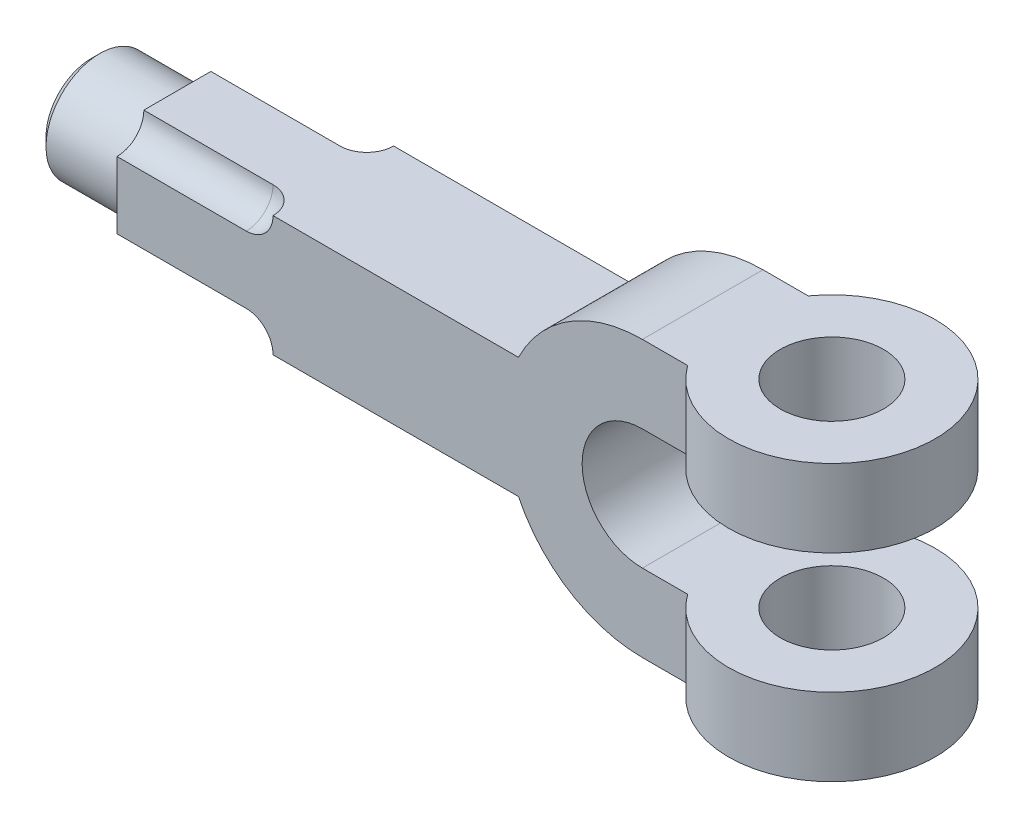
ISO-10303-21;
HEADER;
FILE_DESCRIPTION(('STEP AP214'),'2;1');
FILE_NAME('part.step','',(''),(''),'','','');
FILE_SCHEMA(('AUTOMOTIVE_DESIGN { 1 0 10303 214 1 1 1 1 }'));
ENDSEC;
DATA;
#1=APPLICATION_CONTEXT('core data for automotive mechanical design processes');
#2=APPLICATION_PROTOCOL_DEFINITION('international standard','automotive_design',2000,#1);
#3=PRODUCT_CONTEXT('',#1,'mechanical');
#4=PRODUCT('Part','Part','',(#3));
#5=PRODUCT_RELATED_PRODUCT_CATEGORY('part','',(#4));
#6=PRODUCT_DEFINITION_FORMATION('','',#4);
#7=PRODUCT_DEFINITION_CONTEXT('part definition',#1,'design');
#8=PRODUCT_DEFINITION('design','',#6,#7);
#9=PRODUCT_DEFINITION_SHAPE('','',#8);
#10=(LENGTH_UNIT() NAMED_UNIT(*) SI_UNIT(.MILLI.,.METRE.));
#11=(NAMED_UNIT(*) PLANE_ANGLE_UNIT() SI_UNIT($,.RADIAN.));
#12=(NAMED_UNIT(*) SI_UNIT($,.STERADIAN.) SOLID_ANGLE_UNIT());
#13=UNCERTAINTY_MEASURE_WITH_UNIT(LENGTH_MEASURE(1.E-05),#10,'distance_accuracy_value','');
#14=(GEOMETRIC_REPRESENTATION_CONTEXT(3) GLOBAL_UNCERTAINTY_ASSIGNED_CONTEXT((#13)) GLOBAL_UNIT_ASSIGNED_CONTEXT((#10,
#11,#12)) REPRESENTATION_CONTEXT('',''));
#15=CARTESIAN_POINT('',(0.,0.,0.));
#16=DIRECTION('',(0.,0.,1.));
#17=DIRECTION('',(1.,0.,0.));
#18=AXIS2_PLACEMENT_3D('',#15,#16,#17);
#19=CARTESIAN_POINT('',(-122.,0.,0.));
#20=DIRECTION('',(-1.,0.,0.));
#21=DIRECTION('',(0.,0.,1.));
#22=AXIS2_PLACEMENT_3D('',#19,#20,#21);
#23=PLANE('',#22);
#24=DIRECTION('',(0.,1.,0.));
#25=VECTOR('',#24,1.);
#26=CARTESIAN_POINT('',(-122.,14.,-14.));
#27=LINE('',#26,#25);
#28=CARTESIAN_POINT('',(-122.,-7.78,-14.));
#29=VERTEX_POINT('',#28);
#30=CARTESIAN_POINT('',(-122.,7.78,-14.));
#31=VERTEX_POINT('',#30);
#32=EDGE_CURVE('E228',#29,#31,#27,.T.);
#33=ORIENTED_EDGE('',*,*,#32,.F.);
#34=CARTESIAN_POINT('',(-122.,-14.,-14.));
#35=DIRECTION('',(1.,0.,0.));
#36=DIRECTION('',(0.,0.,1.));
#37=AXIS2_PLACEMENT_3D('',#34,#35,#36);
#38=CIRCLE('',#37,6.22);
#39=CARTESIAN_POINT('',(-122.,-14.,-7.78000000000001));
#40=VERTEX_POINT('',#39);
#41=EDGE_CURVE('E177',#29,#40,#38,.T.);
#42=ORIENTED_EDGE('',*,*,#41,.T.);
#43=DIRECTION('',(0.,0.,-1.));
#44=VECTOR('',#43,1.);
#45=CARTESIAN_POINT('',(-122.,-14.,-14.));
#46=LINE('',#45,#44);
#47=CARTESIAN_POINT('',(-122.,-14.,7.78000000000001));
#48=VERTEX_POINT('',#47);
#49=EDGE_CURVE('E190',#48,#40,#46,.T.);
#50=ORIENTED_EDGE('',*,*,#49,.F.);
#51=CARTESIAN_POINT('',(-122.,-14.,14.));
#52=DIRECTION('',(-1.,0.,0.));
#53=DIRECTION('',(0.,0.,-1.));
#54=AXIS2_PLACEMENT_3D('',#51,#52,#53);
#55=CIRCLE('',#54,6.22);
#56=CARTESIAN_POINT('',(-122.,-7.78,14.));
#57=VERTEX_POINT('',#56);
#58=EDGE_CURVE('E192',#57,#48,#55,.T.);
#59=ORIENTED_EDGE('',*,*,#58,.F.);
#60=DIRECTION('',(0.,-1.,0.));
#61=VECTOR('',#60,1.);
#62=CARTESIAN_POINT('',(-122.,14.,14.));
#63=LINE('',#62,#61);
#64=CARTESIAN_POINT('',(-122.,7.78,14.));
#65=VERTEX_POINT('',#64);
#66=EDGE_CURVE('E224',#65,#57,#63,.T.);
#67=ORIENTED_EDGE('',*,*,#66,.F.);
#68=CARTESIAN_POINT('',(-122.,14.,14.));
#69=DIRECTION('',(1.,0.,0.));
#70=DIRECTION('',(0.,0.,-1.));
#71=AXIS2_PLACEMENT_3D('',#68,#69,#70);
#72=CIRCLE('',#71,6.22);
#73=CARTESIAN_POINT('',(-122.,14.,7.78000000000001));
#74=VERTEX_POINT('',#73);
#75=EDGE_CURVE('E215',#65,#74,#72,.T.);
#76=ORIENTED_EDGE('',*,*,#75,.T.);
#77=DIRECTION('',(0.,0.,1.));
#78=VECTOR('',#77,1.);
#79=CARTESIAN_POINT('',(-122.,14.,-14.));
#80=LINE('',#79,#78);
#81=CARTESIAN_POINT('',(-122.,14.,-7.78000000000001));
#82=VERTEX_POINT('',#81);
#83=EDGE_CURVE('E225',#82,#74,#80,.T.);
#84=ORIENTED_EDGE('',*,*,#83,.F.);
#85=CARTESIAN_POINT('',(-122.,14.,-14.));
#86=DIRECTION('',(-1.,0.,0.));
#87=DIRECTION('',(0.,0.,1.));
#88=AXIS2_PLACEMENT_3D('',#85,#86,#87);
#89=CIRCLE('',#88,6.22);
#90=EDGE_CURVE('E206',#31,#82,#89,.T.);
#91=ORIENTED_EDGE('',*,*,#90,.F.);
#92=EDGE_LOOP('',(#33,#42,#50,#59,#67,#76,#84,#91));
#93=FACE_BOUND('',#92,.T.);
#94=CARTESIAN_POINT('',(-122.,0.,0.));
#95=DIRECTION('',(-1.,0.,0.));
#96=DIRECTION('',(0.,0.,1.));
#97=AXIS2_PLACEMENT_3D('',#94,#95,#96);
#98=CIRCLE('',#97,12.5);
#99=CARTESIAN_POINT('',(-122.,0.,12.5));
#100=VERTEX_POINT('',#99);
#101=EDGE_CURVE('E184',#100,#100,#98,.T.);
#102=ORIENTED_EDGE('',*,*,#101,.F.);
#103=EDGE_LOOP('',(#102));
#104=FACE_BOUND('',#103,.T.);
#105=ADVANCED_FACE('F33',(#93,#104),#23,.T.);
#106=CARTESIAN_POINT('',(500000.,-14.,-14.));
#107=DIRECTION('',(0.,1.,0.));
#108=DIRECTION('',(0.,0.,1.));
#109=AXIS2_PLACEMENT_3D('',#106,#107,#108);
#110=PLANE('',#109);
#111=DIRECTION('',(1.,0.,0.));
#112=VECTOR('',#111,1.);
#113=CARTESIAN_POINT('',(-28.7749891398763,-14.,-7.78));
#114=LINE('',#113,#112);
#115=CARTESIAN_POINT('',(-92.,-14.,-7.77999999999999));
#116=VERTEX_POINT('',#115);
#117=EDGE_CURVE('E176',#116,#40,#114,.F.);
#118=ORIENTED_EDGE('',*,*,#117,.F.);
#119=CARTESIAN_POINT('',(-92.,-14.,-14.));
#120=DIRECTION('',(0.,1.,0.));
#121=DIRECTION('',(0.,0.,1.));
#122=AXIS2_PLACEMENT_3D('',#119,#120,#121);
#123=CIRCLE('',#122,6.22000000000002);
#124=CARTESIAN_POINT('',(-85.78,-14.,-14.));
#125=VERTEX_POINT('',#124);
#126=EDGE_CURVE('E168',#125,#116,#123,.F.);
#127=ORIENTED_EDGE('',*,*,#126,.F.);
#128=DIRECTION('',(-1.,0.,0.));
#129=VECTOR('',#128,1.);
#130=CARTESIAN_POINT('',(500000.,-14.,-14.));
#131=LINE('',#130,#129);
#132=CARTESIAN_POINT('',(-28.7749891398763,-14.,-14.));
#133=VERTEX_POINT('',#132);
#134=EDGE_CURVE('E238',#133,#125,#131,.T.);
#135=ORIENTED_EDGE('',*,*,#134,.F.);
#136=DIRECTION('',(0.,0.,-1.));
#137=VECTOR('',#136,1.);
#138=CARTESIAN_POINT('',(-28.7749891398763,-14.,14.));
#139=LINE('',#138,#137);
#140=CARTESIAN_POINT('',(-28.774989139879,-13.9999999999945,14.));
#141=VERTEX_POINT('',#140);
#142=EDGE_CURVE('E242',#141,#133,#139,.T.);
#143=ORIENTED_EDGE('',*,*,#142,.F.);
#144=DIRECTION('',(-1.,0.,0.));
#145=VECTOR('',#144,1.);
#146=CARTESIAN_POINT('',(500000.,-14.,14.));
#147=LINE('',#146,#145);
#148=CARTESIAN_POINT('',(-85.78,-14.,14.));
#149=VERTEX_POINT('',#148);
#150=EDGE_CURVE('E239',#141,#149,#147,.T.);
#151=ORIENTED_EDGE('',*,*,#150,.T.);
#152=CARTESIAN_POINT('',(-92.,-14.,14.));
#153=DIRECTION('',(0.,1.,0.));
#154=DIRECTION('',(0.,0.,1.));
#155=AXIS2_PLACEMENT_3D('',#152,#153,#154);
#156=CIRCLE('',#155,6.22000000000002);
#157=CARTESIAN_POINT('',(-92.,-14.,7.77999999999999));
#158=VERTEX_POINT('',#157);
#159=EDGE_CURVE('E331',#158,#149,#156,.F.);
#160=ORIENTED_EDGE('',*,*,#159,.F.);
#161=DIRECTION('',(1.,0.,0.));
#162=VECTOR('',#161,1.);
#163=CARTESIAN_POINT('',(-28.7749891398763,-14.,7.78));
#164=LINE('',#163,#162);
#165=EDGE_CURVE('E333',#48,#158,#164,.T.);
#166=ORIENTED_EDGE('',*,*,#165,.F.);
#167=ORIENTED_EDGE('',*,*,#49,.T.);
#168=EDGE_LOOP('',(#118,#127,#135,#143,#151,#160,#166,#167));
#169=FACE_BOUND('',#168,.T.);
#170=ADVANCED_FACE('F187',(#169),#110,.F.);
#171=CARTESIAN_POINT('',(0.,0.,-14.));
#172=DIRECTION('',(0.,0.,1.));
#173=DIRECTION('',(1.,0.,0.));
#174=AXIS2_PLACEMENT_3D('',#171,#172,#173);
#175=PLANE('',#174);
#176=DIRECTION('',(1.,0.,0.));
#177=VECTOR('',#176,1.);
#178=CARTESIAN_POINT('',(-28.7749891398763,-7.78,-14.));
#179=LINE('',#178,#177);
#180=CARTESIAN_POINT('',(-92.,-7.78,-14.));
#181=VERTEX_POINT('',#180);
#182=EDGE_CURVE('E183',#29,#181,#179,.T.);
#183=ORIENTED_EDGE('',*,*,#182,.F.);
#184=ORIENTED_EDGE('',*,*,#32,.T.);
#185=DIRECTION('',(1.,0.,0.));
#186=VECTOR('',#185,1.);
#187=CARTESIAN_POINT('',(-28.7749891398763,7.78,-14.));
#188=LINE('',#187,#186);
#189=CARTESIAN_POINT('',(-92.,7.78,-14.));
#190=VERTEX_POINT('',#189);
#191=EDGE_CURVE('E328',#190,#31,#188,.F.);
#192=ORIENTED_EDGE('',*,*,#191,.F.);
#193=CARTESIAN_POINT('',(-92.,14.,-14.));
#194=DIRECTION('',(0.,0.,1.));
#195=DIRECTION('',(1.,0.,0.));
#196=AXIS2_PLACEMENT_3D('',#193,#194,#195);
#197=CIRCLE('',#196,6.22000000000002);
#198=CARTESIAN_POINT('',(-85.78,14.,-14.));
#199=VERTEX_POINT('',#198);
#200=EDGE_CURVE('E326',#199,#190,#197,.F.);
#201=ORIENTED_EDGE('',*,*,#200,.F.);
#202=DIRECTION('',(-1.,0.,0.));
#203=VECTOR('',#202,1.);
#204=CARTESIAN_POINT('',(500000.,14.,-14.));
#205=LINE('',#204,#203);
#206=CARTESIAN_POINT('',(-28.7749891398903,14.,-14.));
#207=VERTEX_POINT('',#206);
#208=EDGE_CURVE('E235',#207,#199,#205,.T.);
#209=ORIENTED_EDGE('',*,*,#208,.F.);
#210=CARTESIAN_POINT('',(0.,0.,-14.));
#211=DIRECTION('',(0.,0.,1.));
#212=DIRECTION('',(1.,0.,0.));
#213=AXIS2_PLACEMENT_3D('',#210,#211,#212);
#214=CIRCLE('',#213,32.);
#215=CARTESIAN_POINT('',(0.,32.,-14.));
#216=VERTEX_POINT('',#215);
#217=EDGE_CURVE('E290',#216,#207,#214,.T.);
#218=ORIENTED_EDGE('',*,*,#217,.F.);
#219=DIRECTION('',(-1.,0.,0.));
#220=VECTOR('',#219,1.);
#221=CARTESIAN_POINT('',(0.,32.,-14.));
#222=LINE('',#221,#220);
#223=CARTESIAN_POINT('',(10.5064113103821,32.,-14.));
#224=VERTEX_POINT('',#223);
#225=EDGE_CURVE('E302',#224,#216,#222,.T.);
#226=ORIENTED_EDGE('',*,*,#225,.F.);
#227=DIRECTION('',(0.,1.,0.));
#228=VECTOR('',#227,1.);
#229=CARTESIAN_POINT('',(10.5064113103821,14.,-14.));
#230=LINE('',#229,#228);
#231=CARTESIAN_POINT('',(10.5064113103821,14.,-14.));
#232=VERTEX_POINT('',#231);
#233=EDGE_CURVE('E315',#224,#232,#230,.F.);
#234=ORIENTED_EDGE('',*,*,#233,.T.);
#235=DIRECTION('',(1.,0.,0.));
#236=VECTOR('',#235,1.);
#237=CARTESIAN_POINT('',(0.,14.,-14.));
#238=LINE('',#237,#236);
#239=CARTESIAN_POINT('',(0.,14.,-14.));
#240=VERTEX_POINT('',#239);
#241=EDGE_CURVE('E299',#240,#232,#238,.T.);
#242=ORIENTED_EDGE('',*,*,#241,.F.);
#243=CARTESIAN_POINT('',(0.,0.,-14.));
#244=DIRECTION('',(0.,0.,-1.));
#245=DIRECTION('',(1.,0.,0.));
#246=AXIS2_PLACEMENT_3D('',#243,#244,#245);
#247=CIRCLE('',#246,14.);
#248=CARTESIAN_POINT('',(0.,-14.,-14.));
#249=VERTEX_POINT('',#248);
#250=EDGE_CURVE('E297',#249,#240,#247,.T.);
#251=ORIENTED_EDGE('',*,*,#250,.F.);
#252=DIRECTION('',(-1.,0.,0.));
#253=VECTOR('',#252,1.);
#254=CARTESIAN_POINT('',(0.,-14.,-14.));
#255=LINE('',#254,#253);
#256=CARTESIAN_POINT('',(10.5064113103821,-14.,-14.));
#257=VERTEX_POINT('',#256);
#258=EDGE_CURVE('E295',#257,#249,#255,.T.);
#259=ORIENTED_EDGE('',*,*,#258,.F.);
#260=DIRECTION('',(0.,-1.,0.));
#261=VECTOR('',#260,1.);
#262=CARTESIAN_POINT('',(10.5064113103821,-14.,-14.));
#263=LINE('',#262,#261);
#264=CARTESIAN_POINT('',(10.5064113103821,-32.,-14.));
#265=VERTEX_POINT('',#264);
#266=EDGE_CURVE('E318',#265,#257,#263,.F.);
#267=ORIENTED_EDGE('',*,*,#266,.F.);
#268=DIRECTION('',(1.,0.,0.));
#269=VECTOR('',#268,1.);
#270=CARTESIAN_POINT('',(0.,-32.,-14.));
#271=LINE('',#270,#269);
#272=CARTESIAN_POINT('',(0.,-32.,-14.));
#273=VERTEX_POINT('',#272);
#274=EDGE_CURVE('E292',#273,#265,#271,.T.);
#275=ORIENTED_EDGE('',*,*,#274,.F.);
#276=EDGE_CURVE('E273',#133,#273,#214,.T.);
#277=ORIENTED_EDGE('',*,*,#276,.F.);
#278=ORIENTED_EDGE('',*,*,#134,.T.);
#279=CARTESIAN_POINT('',(-92.,-14.,-14.));
#280=DIRECTION('',(0.,0.,1.));
#281=DIRECTION('',(1.,0.,0.));
#282=AXIS2_PLACEMENT_3D('',#279,#280,#281);
#283=CIRCLE('',#282,6.22000000000002);
#284=EDGE_CURVE('E171',#181,#125,#283,.F.);
#285=ORIENTED_EDGE('',*,*,#284,.F.);
#286=EDGE_LOOP('',(#183,#184,#192,#201,#209,#218,#226,#234,#242,#251,#259,#267,#275,#277,#278,#285));
#287=FACE_BOUND('',#286,.T.);
#288=ADVANCED_FACE('F355',(#287),#175,.F.);
#289=CARTESIAN_POINT('',(0.,0.,14.));
#290=DIRECTION('',(0.,0.,1.));
#291=DIRECTION('',(1.,0.,0.));
#292=AXIS2_PLACEMENT_3D('',#289,#290,#291);
#293=PLANE('',#292);
#294=ORIENTED_EDGE('',*,*,#66,.T.);
#295=DIRECTION('',(1.,0.,0.));
#296=VECTOR('',#295,1.);
#297=CARTESIAN_POINT('',(-28.7749891398763,-7.78,14.));
#298=LINE('',#297,#296);
#299=CARTESIAN_POINT('',(-92.,-7.78,14.));
#300=VERTEX_POINT('',#299);
#301=EDGE_CURVE('E200',#57,#300,#298,.T.);
#302=ORIENTED_EDGE('',*,*,#301,.T.);
#303=CARTESIAN_POINT('',(-92.,-14.,14.));
#304=DIRECTION('',(0.,0.,1.));
#305=DIRECTION('',(1.,0.,0.));
#306=AXIS2_PLACEMENT_3D('',#303,#304,#305);
#307=CIRCLE('',#306,6.22000000000002);
#308=EDGE_CURVE('E197',#300,#149,#307,.F.);
#309=ORIENTED_EDGE('',*,*,#308,.T.);
#310=ORIENTED_EDGE('',*,*,#150,.F.);
#311=CARTESIAN_POINT('',(0.,0.,14.));
#312=DIRECTION('',(0.,0.,1.));
#313=DIRECTION('',(1.,0.,0.));
#314=AXIS2_PLACEMENT_3D('',#311,#312,#313);
#315=CIRCLE('',#314,32.);
#316=CARTESIAN_POINT('',(0.,-32.,14.));
#317=VERTEX_POINT('',#316);
#318=EDGE_CURVE('E278',#141,#317,#315,.T.);
#319=ORIENTED_EDGE('',*,*,#318,.T.);
#320=DIRECTION('',(1.,0.,0.));
#321=VECTOR('',#320,1.);
#322=CARTESIAN_POINT('',(0.,-32.,14.));
#323=LINE('',#322,#321);
#324=CARTESIAN_POINT('',(10.5064113103821,-32.,14.));
#325=VERTEX_POINT('',#324);
#326=EDGE_CURVE('E277',#317,#325,#323,.T.);
#327=ORIENTED_EDGE('',*,*,#326,.T.);
#328=DIRECTION('',(0.,-1.,0.));
#329=VECTOR('',#328,1.);
#330=CARTESIAN_POINT('',(10.5064113103821,-14.,14.));
#331=LINE('',#330,#329);
#332=CARTESIAN_POINT('',(10.5064113103821,-14.,14.));
#333=VERTEX_POINT('',#332);
#334=EDGE_CURVE('E257',#325,#333,#331,.F.);
#335=ORIENTED_EDGE('',*,*,#334,.T.);
#336=DIRECTION('',(-1.,0.,0.));
#337=VECTOR('',#336,1.);
#338=CARTESIAN_POINT('',(0.,-14.,14.));
#339=LINE('',#338,#337);
#340=CARTESIAN_POINT('',(0.,-14.,14.));
#341=VERTEX_POINT('',#340);
#342=EDGE_CURVE('E280',#333,#341,#339,.T.);
#343=ORIENTED_EDGE('',*,*,#342,.T.);
#344=CARTESIAN_POINT('',(0.,0.,14.));
#345=DIRECTION('',(0.,0.,-1.));
#346=DIRECTION('',(1.,0.,0.));
#347=AXIS2_PLACEMENT_3D('',#344,#345,#346);
#348=CIRCLE('',#347,14.);
#349=CARTESIAN_POINT('',(0.,14.,14.));
#350=VERTEX_POINT('',#349);
#351=EDGE_CURVE('E282',#341,#350,#348,.T.);
#352=ORIENTED_EDGE('',*,*,#351,.T.);
#353=DIRECTION('',(1.,0.,0.));
#354=VECTOR('',#353,1.);
#355=CARTESIAN_POINT('',(0.,14.,14.));
#356=LINE('',#355,#354);
#357=CARTESIAN_POINT('',(10.5064113103821,14.,14.));
#358=VERTEX_POINT('',#357);
#359=EDGE_CURVE('E284',#350,#358,#356,.T.);
#360=ORIENTED_EDGE('',*,*,#359,.T.);
#361=DIRECTION('',(0.,1.,0.));
#362=VECTOR('',#361,1.);
#363=CARTESIAN_POINT('',(10.5064113103821,14.,14.));
#364=LINE('',#363,#362);
#365=CARTESIAN_POINT('',(10.5064113103821,32.,14.));
#366=VERTEX_POINT('',#365);
#367=EDGE_CURVE('E270',#366,#358,#364,.F.);
#368=ORIENTED_EDGE('',*,*,#367,.F.);
#369=DIRECTION('',(-1.,0.,0.));
#370=VECTOR('',#369,1.);
#371=CARTESIAN_POINT('',(0.,32.,14.));
#372=LINE('',#371,#370);
#373=CARTESIAN_POINT('',(0.,32.,14.));
#374=VERTEX_POINT('',#373);
#375=EDGE_CURVE('E287',#366,#374,#372,.T.);
#376=ORIENTED_EDGE('',*,*,#375,.T.);
#377=CARTESIAN_POINT('',(-28.7749891398763,14.,14.));
#378=VERTEX_POINT('',#377);
#379=EDGE_CURVE('E274',#374,#378,#315,.T.);
#380=ORIENTED_EDGE('',*,*,#379,.T.);
#381=DIRECTION('',(-1.,0.,0.));
#382=VECTOR('',#381,1.);
#383=CARTESIAN_POINT('',(500000.,14.,14.));
#384=LINE('',#383,#382);
#385=CARTESIAN_POINT('',(-85.78,14.,14.));
#386=VERTEX_POINT('',#385);
#387=EDGE_CURVE('E227',#378,#386,#384,.T.);
#388=ORIENTED_EDGE('',*,*,#387,.T.);
#389=CARTESIAN_POINT('',(-92.,14.,14.));
#390=DIRECTION('',(0.,0.,1.));
#391=DIRECTION('',(1.,0.,0.));
#392=AXIS2_PLACEMENT_3D('',#389,#390,#391);
#393=CIRCLE('',#392,6.22000000000002);
#394=CARTESIAN_POINT('',(-92.,7.78,14.));
#395=VERTEX_POINT('',#394);
#396=EDGE_CURVE('E218',#386,#395,#393,.F.);
#397=ORIENTED_EDGE('',*,*,#396,.T.);
#398=DIRECTION('',(1.,0.,0.));
#399=VECTOR('',#398,1.);
#400=CARTESIAN_POINT('',(-28.7749891398763,7.78,14.));
#401=LINE('',#400,#399);
#402=EDGE_CURVE('E221',#395,#65,#401,.F.);
#403=ORIENTED_EDGE('',*,*,#402,.T.);
#404=EDGE_LOOP('',(#294,#302,#309,#310,#319,#327,#335,#343,#352,#360,#368,#376,#380,#388,#397,#403));
#405=FACE_BOUND('',#404,.T.);
#406=ADVANCED_FACE('F366',(#405),#293,.T.);
#407=CARTESIAN_POINT('',(500000.,14.,-14.));
#408=DIRECTION('',(0.,-1.,0.));
#409=DIRECTION('',(0.,0.,-1.));
#410=AXIS2_PLACEMENT_3D('',#407,#408,#409);
#411=PLANE('',#410);
#412=DIRECTION('',(1.,0.,0.));
#413=VECTOR('',#412,1.);
#414=CARTESIAN_POINT('',(-28.7749891398763,14.,-7.78));
#415=LINE('',#414,#413);
#416=CARTESIAN_POINT('',(-92.,14.,-7.77999999999999));
#417=VERTEX_POINT('',#416);
#418=EDGE_CURVE('E210',#82,#417,#415,.T.);
#419=ORIENTED_EDGE('',*,*,#418,.F.);
#420=ORIENTED_EDGE('',*,*,#83,.T.);
#421=DIRECTION('',(1.,0.,0.));
#422=VECTOR('',#421,1.);
#423=CARTESIAN_POINT('',(-28.7749891398763,14.,7.78));
#424=LINE('',#423,#422);
#425=CARTESIAN_POINT('',(-92.,14.,7.77999999999999));
#426=VERTEX_POINT('',#425);
#427=EDGE_CURVE('E323',#426,#74,#424,.F.);
#428=ORIENTED_EDGE('',*,*,#427,.F.);
#429=CARTESIAN_POINT('',(-92.,14.,14.));
#430=DIRECTION('',(0.,-1.,0.));
#431=DIRECTION('',(0.,0.,-1.));
#432=AXIS2_PLACEMENT_3D('',#429,#430,#431);
#433=CIRCLE('',#432,6.22000000000002);
#434=EDGE_CURVE('E321',#386,#426,#433,.F.);
#435=ORIENTED_EDGE('',*,*,#434,.F.);
#436=ORIENTED_EDGE('',*,*,#387,.F.);
#437=DIRECTION('',(0.,0.,-1.));
#438=VECTOR('',#437,1.);
#439=CARTESIAN_POINT('',(-28.7749891398763,14.,14.));
#440=LINE('',#439,#438);
#441=EDGE_CURVE('E244',#207,#378,#440,.F.);
#442=ORIENTED_EDGE('',*,*,#441,.F.);
#443=ORIENTED_EDGE('',*,*,#208,.T.);
#444=CARTESIAN_POINT('',(-92.,14.,-14.));
#445=DIRECTION('',(0.,-1.,0.));
#446=DIRECTION('',(0.,0.,-1.));
#447=AXIS2_PLACEMENT_3D('',#444,#445,#446);
#448=CIRCLE('',#447,6.22000000000002);
#449=EDGE_CURVE('E208',#417,#199,#448,.F.);
#450=ORIENTED_EDGE('',*,*,#449,.F.);
#451=EDGE_LOOP('',(#419,#420,#428,#435,#436,#442,#443,#450));
#452=FACE_BOUND('',#451,.T.);
#453=ADVANCED_FACE('F363',(#452),#411,.F.);
#454=CARTESIAN_POINT('',(0.,0.,14.));
#455=DIRECTION('',(0.,0.,-1.));
#456=DIRECTION('',(-1.,0.,0.));
#457=AXIS2_PLACEMENT_3D('',#454,#455,#456);
#458=CYLINDRICAL_SURFACE('',#457,32.);
#459=ORIENTED_EDGE('',*,*,#142,.T.);
#460=ORIENTED_EDGE('',*,*,#276,.T.);
#461=DIRECTION('',(0.,0.,-1.));
#462=VECTOR('',#461,1.);
#463=CARTESIAN_POINT('',(0.,-32.,14.));
#464=LINE('',#463,#462);
#465=EDGE_CURVE('E312',#317,#273,#464,.T.);
#466=ORIENTED_EDGE('',*,*,#465,.F.);
#467=ORIENTED_EDGE('',*,*,#318,.F.);
#468=EDGE_LOOP('',(#459,#460,#466,#467));
#469=FACE_BOUND('',#468,.T.);
#470=ADVANCED_FACE('F365',(#469),#458,.T.);
#471=ORIENTED_EDGE('',*,*,#441,.T.);
#472=ORIENTED_EDGE('',*,*,#379,.F.);
#473=DIRECTION('',(0.,0.,-1.));
#474=VECTOR('',#473,1.);
#475=CARTESIAN_POINT('',(0.,32.,14.));
#476=LINE('',#475,#474);
#477=EDGE_CURVE('E289',#374,#216,#476,.T.);
#478=ORIENTED_EDGE('',*,*,#477,.T.);
#479=ORIENTED_EDGE('',*,*,#217,.T.);
#480=EDGE_LOOP('',(#471,#472,#478,#479));
#481=FACE_BOUND('',#480,.T.);
#482=ADVANCED_FACE('F409',(#481),#458,.T.);
#483=CARTESIAN_POINT('',(0.,-32.,14.));
#484=DIRECTION('',(0.,1.,0.));
#485=DIRECTION('',(0.,0.,1.));
#486=AXIS2_PLACEMENT_3D('',#483,#484,#485);
#487=PLANE('',#486);
#488=CARTESIAN_POINT('',(30.,-32.,0.));
#489=DIRECTION('',(0.,1.,0.));
#490=DIRECTION('',(0.,0.,1.));
#491=AXIS2_PLACEMENT_3D('',#488,#489,#490);
#492=CIRCLE('',#491,12.);
#493=CARTESIAN_POINT('',(30.,-32.,12.));
#494=VERTEX_POINT('',#493);
#495=EDGE_CURVE('E246',#494,#494,#492,.T.);
#496=ORIENTED_EDGE('',*,*,#495,.T.);
#497=EDGE_LOOP('',(#496));
#498=FACE_BOUND('',#497,.T.);
#499=CARTESIAN_POINT('',(30.,-32.,0.));
#500=DIRECTION('',(0.,1.,0.));
#501=DIRECTION('',(0.,0.,1.));
#502=AXIS2_PLACEMENT_3D('',#499,#500,#501);
#503=CIRCLE('',#502,24.);
#504=EDGE_CURVE('E251',#325,#265,#503,.T.);
#505=ORIENTED_EDGE('',*,*,#504,.F.);
#506=ORIENTED_EDGE('',*,*,#326,.F.);
#507=ORIENTED_EDGE('',*,*,#465,.T.);
#508=ORIENTED_EDGE('',*,*,#274,.T.);
#509=EDGE_LOOP('',(#505,#506,#507,#508));
#510=FACE_BOUND('',#509,.T.);
#511=ADVANCED_FACE('F406',(#498,#510),#487,.F.);
#512=CARTESIAN_POINT('',(0.,-14.,14.));
#513=DIRECTION('',(0.,-1.,0.));
#514=DIRECTION('',(0.,0.,-1.));
#515=AXIS2_PLACEMENT_3D('',#512,#513,#514);
#516=PLANE('',#515);
#517=CARTESIAN_POINT('',(30.,-14.,0.));
#518=DIRECTION('',(0.,1.,0.));
#519=DIRECTION('',(0.,0.,1.));
#520=AXIS2_PLACEMENT_3D('',#517,#518,#519);
#521=CIRCLE('',#520,12.);
#522=CARTESIAN_POINT('',(30.,-14.,12.));
#523=VERTEX_POINT('',#522);
#524=EDGE_CURVE('E248',#523,#523,#521,.T.);
#525=ORIENTED_EDGE('',*,*,#524,.F.);
#526=EDGE_LOOP('',(#525));
#527=FACE_BOUND('',#526,.T.);
#528=CARTESIAN_POINT('',(30.,-14.,0.));
#529=DIRECTION('',(0.,1.,0.));
#530=DIRECTION('',(0.,0.,1.));
#531=AXIS2_PLACEMENT_3D('',#528,#529,#530);
#532=CIRCLE('',#531,24.);
#533=EDGE_CURVE('E254',#333,#257,#532,.T.);
#534=ORIENTED_EDGE('',*,*,#533,.T.);
#535=ORIENTED_EDGE('',*,*,#258,.T.);
#536=DIRECTION('',(0.,0.,-1.));
#537=VECTOR('',#536,1.);
#538=CARTESIAN_POINT('',(0.,-14.,14.));
#539=LINE('',#538,#537);
#540=EDGE_CURVE('E309',#341,#249,#539,.T.);
#541=ORIENTED_EDGE('',*,*,#540,.F.);
#542=ORIENTED_EDGE('',*,*,#342,.F.);
#543=EDGE_LOOP('',(#534,#535,#541,#542));
#544=FACE_BOUND('',#543,.T.);
#545=ADVANCED_FACE('F402',(#527,#544),#516,.F.);
#546=CARTESIAN_POINT('',(0.,0.,14.));
#547=DIRECTION('',(0.,0.,-1.));
#548=DIRECTION('',(-1.,0.,0.));
#549=AXIS2_PLACEMENT_3D('',#546,#547,#548);
#550=CYLINDRICAL_SURFACE('',#549,14.);
#551=ORIENTED_EDGE('',*,*,#250,.T.);
#552=DIRECTION('',(0.,0.,-1.));
#553=VECTOR('',#552,1.);
#554=CARTESIAN_POINT('',(0.,14.,14.));
#555=LINE('',#554,#553);
#556=EDGE_CURVE('E306',#350,#240,#555,.T.);
#557=ORIENTED_EDGE('',*,*,#556,.F.);
#558=ORIENTED_EDGE('',*,*,#351,.F.);
#559=ORIENTED_EDGE('',*,*,#540,.T.);
#560=EDGE_LOOP('',(#551,#557,#558,#559));
#561=FACE_BOUND('',#560,.T.);
#562=ADVANCED_FACE('F398',(#561),#550,.F.);
#563=CARTESIAN_POINT('',(0.,14.,14.));
#564=DIRECTION('',(0.,1.,0.));
#565=DIRECTION('',(0.,0.,1.));
#566=AXIS2_PLACEMENT_3D('',#563,#564,#565);
#567=PLANE('',#566);
#568=ORIENTED_EDGE('',*,*,#241,.T.);
#569=CARTESIAN_POINT('',(30.,14.,0.));
#570=DIRECTION('',(0.,1.,0.));
#571=DIRECTION('',(0.,0.,1.));
#572=AXIS2_PLACEMENT_3D('',#569,#570,#571);
#573=CIRCLE('',#572,24.);
#574=EDGE_CURVE('E268',#358,#232,#573,.T.);
#575=ORIENTED_EDGE('',*,*,#574,.F.);
#576=ORIENTED_EDGE('',*,*,#359,.F.);
#577=ORIENTED_EDGE('',*,*,#556,.T.);
#578=EDGE_LOOP('',(#568,#575,#576,#577));
#579=FACE_BOUND('',#578,.T.);
#580=CARTESIAN_POINT('',(30.,14.,0.));
#581=DIRECTION('',(0.,1.,0.));
#582=DIRECTION('',(0.,0.,1.));
#583=AXIS2_PLACEMENT_3D('',#580,#581,#582);
#584=CIRCLE('',#583,12.);
#585=CARTESIAN_POINT('',(30.,14.,12.));
#586=VERTEX_POINT('',#585);
#587=EDGE_CURVE('E262',#586,#586,#584,.T.);
#588=ORIENTED_EDGE('',*,*,#587,.T.);
#589=EDGE_LOOP('',(#588));
#590=FACE_BOUND('',#589,.T.);
#591=ADVANCED_FACE('F394',(#579,#590),#567,.F.);
#592=CARTESIAN_POINT('',(0.,32.,14.));
#593=DIRECTION('',(0.,-1.,0.));
#594=DIRECTION('',(0.,0.,-1.));
#595=AXIS2_PLACEMENT_3D('',#592,#593,#594);
#596=PLANE('',#595);
#597=CARTESIAN_POINT('',(30.,32.,0.));
#598=DIRECTION('',(0.,1.,0.));
#599=DIRECTION('',(0.,0.,1.));
#600=AXIS2_PLACEMENT_3D('',#597,#598,#599);
#601=CIRCLE('',#600,12.);
#602=CARTESIAN_POINT('',(30.,32.,12.));
#603=VERTEX_POINT('',#602);
#604=EDGE_CURVE('E261',#603,#603,#601,.T.);
#605=ORIENTED_EDGE('',*,*,#604,.F.);
#606=EDGE_LOOP('',(#605));
#607=FACE_BOUND('',#606,.T.);
#608=ORIENTED_EDGE('',*,*,#375,.F.);
#609=CARTESIAN_POINT('',(30.,32.,0.));
#610=DIRECTION('',(0.,1.,0.));
#611=DIRECTION('',(0.,0.,1.));
#612=AXIS2_PLACEMENT_3D('',#609,#610,#611);
#613=CIRCLE('',#612,24.);
#614=EDGE_CURVE('E265',#366,#224,#613,.T.);
#615=ORIENTED_EDGE('',*,*,#614,.T.);
#616=ORIENTED_EDGE('',*,*,#225,.T.);
#617=ORIENTED_EDGE('',*,*,#477,.F.);
#618=EDGE_LOOP('',(#608,#615,#616,#617));
#619=FACE_BOUND('',#618,.T.);
#620=ADVANCED_FACE('F384',(#607,#619),#596,.F.);
#621=CARTESIAN_POINT('',(30.,14.,0.));
#622=DIRECTION('',(0.,1.,0.));
#623=DIRECTION('',(0.,0.,1.));
#624=AXIS2_PLACEMENT_3D('',#621,#622,#623);
#625=CYLINDRICAL_SURFACE('',#624,24.);
#626=ORIENTED_EDGE('',*,*,#614,.F.);
#627=ORIENTED_EDGE('',*,*,#367,.T.);
#628=ORIENTED_EDGE('',*,*,#574,.T.);
#629=ORIENTED_EDGE('',*,*,#233,.F.);
#630=EDGE_LOOP('',(#626,#627,#628,#629));
#631=FACE_BOUND('',#630,.T.);
#632=ADVANCED_FACE('F380',(#631),#625,.T.);
#633=CARTESIAN_POINT('',(30.,14.,0.));
#634=DIRECTION('',(0.,1.,0.));
#635=DIRECTION('',(0.,0.,1.));
#636=AXIS2_PLACEMENT_3D('',#633,#634,#635);
#637=CYLINDRICAL_SURFACE('',#636,12.);
#638=ORIENTED_EDGE('',*,*,#604,.T.);
#639=EDGE_LOOP('',(#638));
#640=FACE_BOUND('',#639,.T.);
#641=ORIENTED_EDGE('',*,*,#587,.F.);
#642=EDGE_LOOP('',(#641));
#643=FACE_BOUND('',#642,.T.);
#644=ADVANCED_FACE('F376',(#640,#643),#637,.F.);
#645=CARTESIAN_POINT('',(30.,-14.,0.));
#646=DIRECTION('',(0.,-1.,0.));
#647=DIRECTION('',(0.,0.,-1.));
#648=AXIS2_PLACEMENT_3D('',#645,#646,#647);
#649=CYLINDRICAL_SURFACE('',#648,24.);
#650=ORIENTED_EDGE('',*,*,#334,.F.);
#651=ORIENTED_EDGE('',*,*,#504,.T.);
#652=ORIENTED_EDGE('',*,*,#266,.T.);
#653=ORIENTED_EDGE('',*,*,#533,.F.);
#654=EDGE_LOOP('',(#650,#651,#652,#653));
#655=FACE_BOUND('',#654,.T.);
#656=ADVANCED_FACE('F372',(#655),#649,.T.);
#657=CARTESIAN_POINT('',(30.,-14.,0.));
#658=DIRECTION('',(0.,-1.,0.));
#659=DIRECTION('',(0.,0.,-1.));
#660=AXIS2_PLACEMENT_3D('',#657,#658,#659);
#661=CYLINDRICAL_SURFACE('',#660,12.);
#662=ORIENTED_EDGE('',*,*,#524,.T.);
#663=EDGE_LOOP('',(#662));
#664=FACE_BOUND('',#663,.T.);
#665=ORIENTED_EDGE('',*,*,#495,.F.);
#666=EDGE_LOOP('',(#665));
#667=FACE_BOUND('',#666,.T.);
#668=ADVANCED_FACE('F369',(#664,#667),#661,.F.);
#669=CARTESIAN_POINT('',(-28.7749891398763,14.,14.));
#670=DIRECTION('',(1.,0.,0.));
#671=DIRECTION('',(0.,0.,-1.));
#672=AXIS2_PLACEMENT_3D('',#669,#670,#671);
#673=CYLINDRICAL_SURFACE('',#672,6.22);
#674=CARTESIAN_POINT('',(-92.,14.,14.));
#675=DIRECTION('',(1.,0.,0.));
#676=DIRECTION('',(0.,0.,-1.));
#677=AXIS2_PLACEMENT_3D('',#674,#675,#676);
#678=CIRCLE('',#677,6.22);
#679=EDGE_CURVE('E212',#395,#426,#678,.T.);
#680=ORIENTED_EDGE('',*,*,#679,.T.);
#681=ORIENTED_EDGE('',*,*,#427,.T.);
#682=ORIENTED_EDGE('',*,*,#75,.F.);
#683=ORIENTED_EDGE('',*,*,#402,.F.);
#684=EDGE_LOOP('',(#680,#681,#682,#683));
#685=FACE_BOUND('',#684,.T.);
#686=ADVANCED_FACE('F361',(#685),#673,.F.);
#687=CARTESIAN_POINT('',(-92.,14.,14.));
#688=DIRECTION('',(1.,0.,0.));
#689=DIRECTION('',(0.,-1.,0.));
#690=AXIS2_PLACEMENT_3D('',#687,#688,#689);
#691=SPHERICAL_SURFACE('',#690,6.22000000000002);
#692=ORIENTED_EDGE('',*,*,#434,.T.);
#693=ORIENTED_EDGE('',*,*,#679,.F.);
#694=ORIENTED_EDGE('',*,*,#396,.F.);
#695=EDGE_LOOP('',(#692,#693,#694));
#696=FACE_BOUND('',#695,.T.);
#697=ADVANCED_FACE('F453',(#696),#691,.F.);
#698=CARTESIAN_POINT('',(-28.7749891398763,14.,-14.));
#699=DIRECTION('',(1.,0.,0.));
#700=DIRECTION('',(0.,0.,1.));
#701=AXIS2_PLACEMENT_3D('',#698,#699,#700);
#702=CYLINDRICAL_SURFACE('',#701,6.22);
#703=ORIENTED_EDGE('',*,*,#418,.T.);
#704=CARTESIAN_POINT('',(-92.,14.,-14.));
#705=DIRECTION('',(-1.,0.,0.));
#706=DIRECTION('',(0.,0.,1.));
#707=AXIS2_PLACEMENT_3D('',#704,#705,#706);
#708=CIRCLE('',#707,6.22);
#709=EDGE_CURVE('E203',#190,#417,#708,.T.);
#710=ORIENTED_EDGE('',*,*,#709,.F.);
#711=ORIENTED_EDGE('',*,*,#191,.T.);
#712=ORIENTED_EDGE('',*,*,#90,.T.);
#713=EDGE_LOOP('',(#703,#710,#711,#712));
#714=FACE_BOUND('',#713,.T.);
#715=ADVANCED_FACE('F475',(#714),#702,.F.);
#716=CARTESIAN_POINT('',(-92.,14.,-14.));
#717=DIRECTION('',(1.,0.,0.));
#718=DIRECTION('',(0.,-1.,0.));
#719=AXIS2_PLACEMENT_3D('',#716,#717,#718);
#720=SPHERICAL_SURFACE('',#719,6.22000000000002);
#721=ORIENTED_EDGE('',*,*,#449,.T.);
#722=ORIENTED_EDGE('',*,*,#200,.T.);
#723=ORIENTED_EDGE('',*,*,#709,.T.);
#724=EDGE_LOOP('',(#721,#722,#723));
#725=FACE_BOUND('',#724,.T.);
#726=ADVANCED_FACE('F469',(#725),#720,.F.);
#727=CARTESIAN_POINT('',(-28.7749891398763,-14.,14.));
#728=DIRECTION('',(1.,0.,0.));
#729=DIRECTION('',(0.,0.,-1.));
#730=AXIS2_PLACEMENT_3D('',#727,#728,#729);
#731=CYLINDRICAL_SURFACE('',#730,6.22);
#732=ORIENTED_EDGE('',*,*,#58,.T.);
#733=ORIENTED_EDGE('',*,*,#165,.T.);
#734=CARTESIAN_POINT('',(-92.,-14.,14.));
#735=DIRECTION('',(-1.,0.,0.));
#736=DIRECTION('',(0.,0.,-1.));
#737=AXIS2_PLACEMENT_3D('',#734,#735,#736);
#738=CIRCLE('',#737,6.22);
#739=EDGE_CURVE('E56',#300,#158,#738,.T.);
#740=ORIENTED_EDGE('',*,*,#739,.F.);
#741=ORIENTED_EDGE('',*,*,#301,.F.);
#742=EDGE_LOOP('',(#732,#733,#740,#741));
#743=FACE_BOUND('',#742,.T.);
#744=ADVANCED_FACE('F459',(#743),#731,.F.);
#745=CARTESIAN_POINT('',(-92.,-14.,14.));
#746=DIRECTION('',(1.,0.,0.));
#747=DIRECTION('',(0.,1.,0.));
#748=AXIS2_PLACEMENT_3D('',#745,#746,#747);
#749=SPHERICAL_SURFACE('',#748,6.22000000000002);
#750=ORIENTED_EDGE('',*,*,#739,.T.);
#751=ORIENTED_EDGE('',*,*,#159,.T.);
#752=ORIENTED_EDGE('',*,*,#308,.F.);
#753=EDGE_LOOP('',(#750,#751,#752));
#754=FACE_BOUND('',#753,.T.);
#755=ADVANCED_FACE('F461',(#754),#749,.F.);
#756=CARTESIAN_POINT('',(-28.7749891398763,-14.,-14.));
#757=DIRECTION('',(1.,0.,0.));
#758=DIRECTION('',(0.,0.,1.));
#759=AXIS2_PLACEMENT_3D('',#756,#757,#758);
#760=CYLINDRICAL_SURFACE('',#759,6.22);
#761=ORIENTED_EDGE('',*,*,#117,.T.);
#762=ORIENTED_EDGE('',*,*,#41,.F.);
#763=ORIENTED_EDGE('',*,*,#182,.T.);
#764=CARTESIAN_POINT('',(-92.,-14.,-14.));
#765=DIRECTION('',(1.,0.,0.));
#766=DIRECTION('',(0.,0.,1.));
#767=AXIS2_PLACEMENT_3D('',#764,#765,#766);
#768=CIRCLE('',#767,6.22);
#769=EDGE_CURVE('E48',#181,#116,#768,.T.);
#770=ORIENTED_EDGE('',*,*,#769,.T.);
#771=EDGE_LOOP('',(#761,#762,#763,#770));
#772=FACE_BOUND('',#771,.T.);
#773=ADVANCED_FACE('F180',(#772),#760,.F.);
#774=CARTESIAN_POINT('',(-92.,-14.,-14.));
#775=DIRECTION('',(1.,0.,0.));
#776=DIRECTION('',(0.,1.,0.));
#777=AXIS2_PLACEMENT_3D('',#774,#775,#776);
#778=SPHERICAL_SURFACE('',#777,6.22000000000002);
#779=ORIENTED_EDGE('',*,*,#126,.T.);
#780=ORIENTED_EDGE('',*,*,#769,.F.);
#781=ORIENTED_EDGE('',*,*,#284,.T.);
#782=EDGE_LOOP('',(#779,#780,#781));
#783=FACE_BOUND('',#782,.T.);
#784=ADVANCED_FACE('F169',(#783),#778,.F.);
#785=CARTESIAN_POINT('',(-142.,0.,0.));
#786=DIRECTION('',(1.,0.,0.));
#787=DIRECTION('',(0.,0.,-1.));
#788=AXIS2_PLACEMENT_3D('',#785,#786,#787);
#789=CYLINDRICAL_SURFACE('',#788,12.5);
#790=CARTESIAN_POINT('',(-140.,0.,0.));
#791=DIRECTION('',(-1.,0.,0.));
#792=DIRECTION('',(0.,0.,1.));
#793=AXIS2_PLACEMENT_3D('',#790,#791,#792);
#794=CIRCLE('',#793,12.5);
#795=CARTESIAN_POINT('',(-140.,0.,12.5));
#796=VERTEX_POINT('',#795);
#797=EDGE_CURVE('E11',#796,#796,#794,.F.);
#798=ORIENTED_EDGE('',*,*,#797,.T.);
#799=EDGE_LOOP('',(#798));
#800=FACE_BOUND('',#799,.T.);
#801=ORIENTED_EDGE('',*,*,#101,.T.);
#802=EDGE_LOOP('',(#801));
#803=FACE_BOUND('',#802,.T.);
#804=ADVANCED_FACE('F346',(#800,#803),#789,.T.);
#805=CARTESIAN_POINT('',(-142.,0.,0.));
#806=DIRECTION('',(-1.,0.,0.));
#807=DIRECTION('',(0.,0.,1.));
#808=AXIS2_PLACEMENT_3D('',#805,#806,#807);
#809=PLANE('',#808);
#810=CARTESIAN_POINT('',(-142.,0.,0.));
#811=DIRECTION('',(-1.,0.,0.));
#812=DIRECTION('',(0.,0.,1.));
#813=AXIS2_PLACEMENT_3D('',#810,#811,#812);
#814=CIRCLE('',#813,10.5);
#815=CARTESIAN_POINT('',(-142.,0.,10.5));
#816=VERTEX_POINT('',#815);
#817=EDGE_CURVE('E41',#816,#816,#814,.T.);
#818=ORIENTED_EDGE('',*,*,#817,.T.);
#819=EDGE_LOOP('',(#818));
#820=FACE_BOUND('',#819,.T.);
#821=ADVANCED_FACE('F339',(#820),#809,.T.);
#822=CARTESIAN_POINT('',(-142.,0.,0.));
#823=DIRECTION('',(1.,0.,0.));
#824=DIRECTION('',(0.,0.,-1.));
#825=AXIS2_PLACEMENT_3D('',#822,#823,#824);
#826=CONICAL_SURFACE('',#825,10.5,0.785398163397446);
#827=ORIENTED_EDGE('',*,*,#797,.F.);
#828=EDGE_LOOP('',(#827));
#829=FACE_BOUND('',#828,.T.);
#830=ORIENTED_EDGE('',*,*,#817,.F.);
#831=EDGE_LOOP('',(#830));
#832=FACE_BOUND('',#831,.T.);
#833=ADVANCED_FACE('F35',(#829,#832),#826,.T.);
#834=CLOSED_SHELL('',(#105,#170,#288,#406,#453,#470,#482,#511,#545,#562,#591,#620,#632,#644,
#656,#668,#686,#697,#715,#726,#744,#755,#773,#784,#804,#821,#833));
#835=MANIFOLD_SOLID_BREP('B2',#834);
#836=ADVANCED_BREP_SHAPE_REPRESENTATION('',(#18,#835),#14);
#837=SHAPE_DEFINITION_REPRESENTATION(#9,#836);
ENDSEC;
END-ISO-10303-21;
